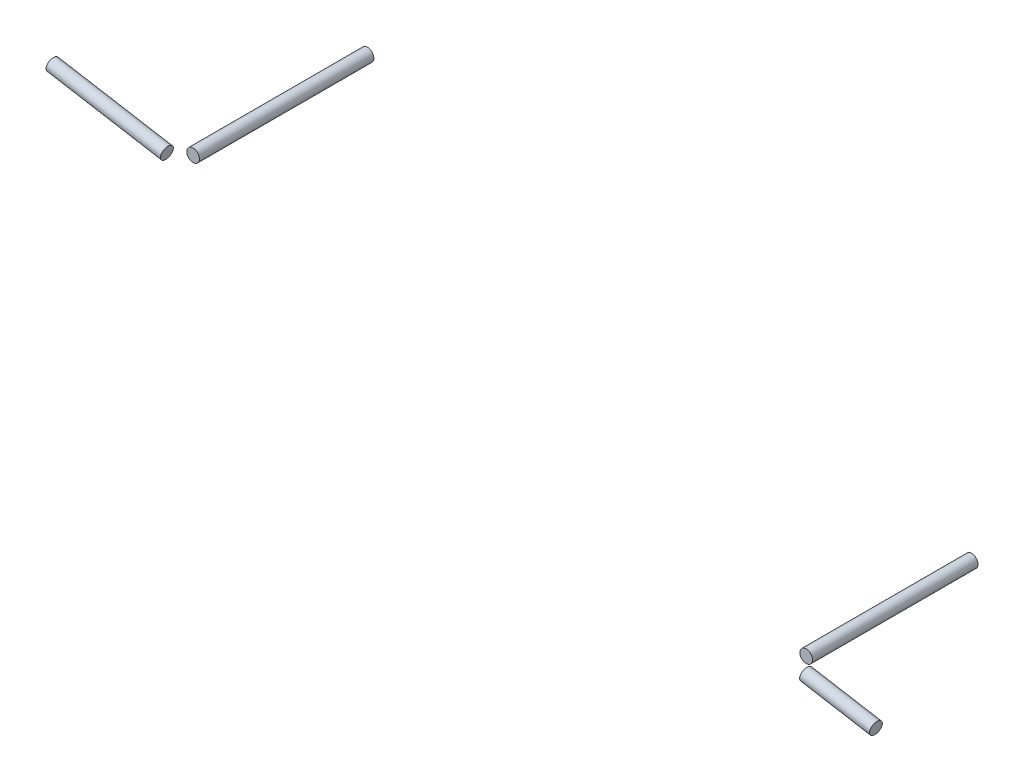
ISO-10303-21;
HEADER;
FILE_DESCRIPTION(('STEP AP214'),'2;1');
FILE_NAME('part.step','',(''),(''),'','','');
FILE_SCHEMA(('AUTOMOTIVE_DESIGN { 1 0 10303 214 1 1 1 1 }'));
ENDSEC;
DATA;
#1=APPLICATION_CONTEXT('core data for automotive mechanical design processes');
#2=APPLICATION_PROTOCOL_DEFINITION('international standard','automotive_design',2000,#1);
#3=PRODUCT_CONTEXT('',#1,'mechanical');
#4=PRODUCT('Part','Part','',(#3));
#5=PRODUCT_RELATED_PRODUCT_CATEGORY('part','',(#4));
#6=PRODUCT_DEFINITION_FORMATION('','',#4);
#7=PRODUCT_DEFINITION_CONTEXT('part definition',#1,'design');
#8=PRODUCT_DEFINITION('design','',#6,#7);
#9=PRODUCT_DEFINITION_SHAPE('','',#8);
#10=(LENGTH_UNIT() NAMED_UNIT(*) SI_UNIT(.MILLI.,.METRE.));
#11=(NAMED_UNIT(*) PLANE_ANGLE_UNIT() SI_UNIT($,.RADIAN.));
#12=(NAMED_UNIT(*) SI_UNIT($,.STERADIAN.) SOLID_ANGLE_UNIT());
#13=UNCERTAINTY_MEASURE_WITH_UNIT(LENGTH_MEASURE(1.E-05),#10,'distance_accuracy_value','');
#14=(GEOMETRIC_REPRESENTATION_CONTEXT(3) GLOBAL_UNCERTAINTY_ASSIGNED_CONTEXT((#13)) GLOBAL_UNIT_ASSIGNED_CONTEXT((#10,
#11,#12)) REPRESENTATION_CONTEXT('',''));
#15=CARTESIAN_POINT('',(0.,0.,0.));
#16=DIRECTION('',(0.,0.,1.));
#17=DIRECTION('',(1.,0.,0.));
#18=AXIS2_PLACEMENT_3D('',#15,#16,#17);
#19=CARTESIAN_POINT('',(-615.000680403424,127.640919006454,-49.811996396273));
#20=DIRECTION('',(0.,0.,1.));
#21=DIRECTION('',(1.,0.,0.));
#22=AXIS2_PLACEMENT_3D('',#19,#20,#21);
#23=CYLINDRICAL_SURFACE('',#22,6.34999999999994);
#24=CARTESIAN_POINT('',(-615.000680403424,127.640919006454,-31.8514841541348));
#25=DIRECTION('',(0.,0.,1.));
#26=DIRECTION('',(1.,0.,0.));
#27=AXIS2_PLACEMENT_3D('',#24,#25,#26);
#28=CIRCLE('',#27,6.34999999999994);
#29=CARTESIAN_POINT('',(-608.650680403424,127.640919006454,-31.8514841541348));
#30=VERTEX_POINT('',#29);
#31=EDGE_CURVE('E11',#30,#30,#28,.F.);
#32=CARTESIAN_POINT('',(-615.000680403424,127.640919006454,143.124127760595));
#33=DIRECTION('',(0.,0.,1.));
#34=DIRECTION('',(1.,0.,0.));
#35=AXIS2_PLACEMENT_3D('',#32,#33,#34);
#36=CIRCLE('',#35,6.34999999999994);
#37=CARTESIAN_POINT('',(-608.650680403424,127.640919006454,143.124127760595));
#38=VERTEX_POINT('',#37);
#39=EDGE_CURVE('E52',#38,#38,#36,.T.);
#40=CARTESIAN_POINT('',(-608.650680403424,127.640919006454,-31.8514841541348));
#41=CARTESIAN_POINT('',(-608.650680403424,127.640919006454,-30.028821530023));
#42=CARTESIAN_POINT('',(-608.650680403424,127.640919006454,-28.2061589059112));
#43=CARTESIAN_POINT('',(-608.650680403424,127.640919006454,-24.5608336576877));
#44=CARTESIAN_POINT('',(-608.650680403424,127.640919006454,-22.7381710335759));
#45=CARTESIAN_POINT('',(-608.650680403424,127.640919006454,-19.0928457853524));
#46=CARTESIAN_POINT('',(-608.650680403424,127.640919006454,-17.2701831612406));
#47=CARTESIAN_POINT('',(-608.650680403424,127.640919006454,-13.6248579130171));
#48=CARTESIAN_POINT('',(-608.650680403424,127.640919006454,-11.8021952889053));
#49=CARTESIAN_POINT('',(-608.650680403424,127.640919006454,-8.15687004068178));
#50=CARTESIAN_POINT('',(-608.650680403424,127.640919006454,-6.33420741657001));
#51=CARTESIAN_POINT('',(-608.650680403424,127.640919006454,-2.68888216834648));
#52=CARTESIAN_POINT('',(-608.650680403424,127.640919006454,-0.866219544234709));
#53=CARTESIAN_POINT('',(-608.650680403424,127.640919006454,2.77910570398883));
#54=CARTESIAN_POINT('',(-608.650680403424,127.640919006454,4.6017683281006));
#55=CARTESIAN_POINT('',(-608.650680403424,127.640919006454,8.24709357632414));
#56=CARTESIAN_POINT('',(-608.650680403424,127.640919006454,10.0697562004359));
#57=CARTESIAN_POINT('',(-608.650680403424,127.640919006454,13.7150814486594));
#58=CARTESIAN_POINT('',(-608.650680403424,127.640919006454,15.5377440727712));
#59=CARTESIAN_POINT('',(-608.650680403424,127.640919006454,19.1830693209947));
#60=CARTESIAN_POINT('',(-608.650680403424,127.640919006454,21.0057319451065));
#61=CARTESIAN_POINT('',(-608.650680403424,127.640919006454,24.6510571933301));
#62=CARTESIAN_POINT('',(-608.650680403424,127.640919006454,26.4737198174418));
#63=CARTESIAN_POINT('',(-608.650680403424,127.640919006454,30.1190450656654));
#64=CARTESIAN_POINT('',(-608.650680403424,127.640919006454,31.9417076897771));
#65=CARTESIAN_POINT('',(-608.650680403424,127.640919006454,35.5870329380007));
#66=CARTESIAN_POINT('',(-608.650680403424,127.640919006454,37.4096955621124));
#67=CARTESIAN_POINT('',(-608.650680403424,127.640919006454,41.055020810336));
#68=CARTESIAN_POINT('',(-608.650680403424,127.640919006454,42.8776834344477));
#69=CARTESIAN_POINT('',(-608.650680403424,127.640919006454,46.5230086826713));
#70=CARTESIAN_POINT('',(-608.650680403424,127.640919006454,48.345671306783));
#71=CARTESIAN_POINT('',(-608.650680403424,127.640919006454,51.9909965550066));
#72=CARTESIAN_POINT('',(-608.650680403424,127.640919006454,53.8136591791184));
#73=CARTESIAN_POINT('',(-608.650680403424,127.640919006454,57.4589844273419));
#74=CARTESIAN_POINT('',(-608.650680403424,127.640919006454,59.2816470514537));
#75=CARTESIAN_POINT('',(-608.650680403424,127.640919006454,62.9269722996772));
#76=CARTESIAN_POINT('',(-608.650680403424,127.640919006454,64.749634923789));
#77=CARTESIAN_POINT('',(-608.650680403424,127.640919006454,68.3949601720125));
#78=CARTESIAN_POINT('',(-608.650680403424,127.640919006454,70.2176227961243));
#79=CARTESIAN_POINT('',(-608.650680403424,127.640919006454,73.8629480443478));
#80=CARTESIAN_POINT('',(-608.650680403424,127.640919006454,75.6856106684596));
#81=CARTESIAN_POINT('',(-608.650680403424,127.640919006454,79.3309359166831));
#82=CARTESIAN_POINT('',(-608.650680403424,127.640919006454,81.1535985407949));
#83=CARTESIAN_POINT('',(-608.650680403424,127.640919006454,84.7989237890184));
#84=CARTESIAN_POINT('',(-608.650680403424,127.640919006454,86.6215864131302));
#85=CARTESIAN_POINT('',(-608.650680403424,127.640919006454,90.2669116613537));
#86=CARTESIAN_POINT('',(-608.650680403424,127.640919006454,92.0895742854655));
#87=CARTESIAN_POINT('',(-608.650680403424,127.640919006454,95.734899533689));
#88=CARTESIAN_POINT('',(-608.650680403424,127.640919006454,97.5575621578008));
#89=CARTESIAN_POINT('',(-608.650680403424,127.640919006454,101.202887406024));
#90=CARTESIAN_POINT('',(-608.650680403424,127.640919006454,103.025550030136));
#91=CARTESIAN_POINT('',(-608.650680403424,127.640919006454,106.67087527836));
#92=CARTESIAN_POINT('',(-608.650680403424,127.640919006454,108.493537902471));
#93=CARTESIAN_POINT('',(-608.650680403424,127.640919006454,112.138863150695));
#94=CARTESIAN_POINT('',(-608.650680403424,127.640919006454,113.961525774807));
#95=CARTESIAN_POINT('',(-608.650680403424,127.640919006454,117.60685102303));
#96=CARTESIAN_POINT('',(-608.650680403424,127.640919006454,119.429513647142));
#97=CARTESIAN_POINT('',(-608.650680403424,127.640919006454,123.074838895366));
#98=CARTESIAN_POINT('',(-608.650680403424,127.640919006454,124.897501519477));
#99=CARTESIAN_POINT('',(-608.650680403424,127.640919006454,128.542826767701));
#100=CARTESIAN_POINT('',(-608.650680403424,127.640919006454,130.365489391813));
#101=CARTESIAN_POINT('',(-608.650680403424,127.640919006454,134.010814640036));
#102=CARTESIAN_POINT('',(-608.650680403424,127.640919006454,135.833477264148));
#103=CARTESIAN_POINT('',(-608.650680403424,127.640919006454,139.478802512371));
#104=CARTESIAN_POINT('',(-608.650680403424,127.640919006454,141.301465136483));
#105=CARTESIAN_POINT('',(-608.650680403424,127.640919006454,143.124127760595));
#106=B_SPLINE_CURVE_WITH_KNOTS('',3,(#40,#41,#42,#43,#44,#45,#46,#47,#48,#49,#50,#51,#52,#53,
#54,#55,#56,#57,#58,#59,#60,#61,#62,#63,#64,#65,#66,#67,#68,#69,#70,#71,#72,#73,#74,#75,#76,#77,
#78,#79,#80,#81,#82,#83,#84,#85,#86,#87,#88,#89,#90,#91,#92,#93,#94,#95,#96,#97,#98,#99,#100,
#101,#102,#103,#104,#105),.UNSPECIFIED.,.F.,.F.,(4,2,2,2,2,2,2,2,2,2,2,2,2,2,2,2,2,2,2,2,2,2,2,
2,2,2,2,2,2,2,2,2,4),(0.,5.46798787233531,10.9359757446706,16.4039636170059,21.8719514893412,
27.3399393616765,32.8079272340118,38.2759151063471,43.7439029786824,49.2118908510177,
54.6798787233531,60.1478665956884,65.6158544680237,71.083842340359,76.5518302126943,
82.0198180850296,87.4878059573649,92.9557938297002,98.4237817020355,103.891769574371,
109.359757446706,114.827745319041,120.295733191377,125.763721063712,131.231708936047,
136.699696808383,142.167684680718,147.635672553053,153.103660425389,158.571648297724,
164.039636170059,169.507624042394,174.97561191473),.UNSPECIFIED.);
#107=EDGE_CURVE('BSEAM46',#30,#38,#106,.T.);
#108=ORIENTED_EDGE('',*,*,#31,.F.);
#109=ORIENTED_EDGE('',*,*,#39,.F.);
#110=ORIENTED_EDGE('',*,*,#107,.T.);
#111=ORIENTED_EDGE('',*,*,#107,.F.);
#112=EDGE_LOOP('',(#108,#110,#109,#111));
#113=FACE_BOUND('',#112,.T.);
#114=ADVANCED_FACE('F46',(#113),#23,.T.);
#115=CARTESIAN_POINT('',(-615.000680403424,127.640919006454,143.124127760595));
#116=DIRECTION('',(0.,0.,1.));
#117=DIRECTION('',(1.,0.,0.));
#118=AXIS2_PLACEMENT_3D('',#115,#116,#117);
#119=PLANE('',#118);
#120=ORIENTED_EDGE('',*,*,#39,.T.);
#121=EDGE_LOOP('',(#120));
#122=FACE_BOUND('',#121,.T.);
#123=ADVANCED_FACE('F58',(#122),#119,.T.);
#124=CARTESIAN_POINT('',(0.,0.,-31.8514841541348));
#125=DIRECTION('',(0.,0.,1.));
#126=DIRECTION('',(1.,0.,0.));
#127=AXIS2_PLACEMENT_3D('',#124,#125,#126);
#128=PLANE('',#127);
#129=ORIENTED_EDGE('',*,*,#31,.T.);
#130=EDGE_LOOP('',(#129));
#131=FACE_BOUND('',#130,.T.);
#132=ADVANCED_FACE('F65',(#131),#128,.F.);
#133=CLOSED_SHELL('',(#114,#123,#132));
#134=MANIFOLD_SOLID_BREP('B2',#133);
#135=CARTESIAN_POINT('',(-631.725947745237,108.235350192216,0.));
#136=DIRECTION('',(0.985637977292356,-0.168872075012515,0.));
#137=DIRECTION('',(0.168872075012515,0.985637977292356,0.));
#138=AXIS2_PLACEMENT_3D('',#135,#136,#137);
#139=PLANE('',#138);
#140=CARTESIAN_POINT('',(-628.018986807503,129.871381373208,156.332127760596));
#141=DIRECTION('',(0.985637977292356,-0.168872075012515,0.));
#142=DIRECTION('',(0.168872075012515,0.985637977292356,0.));
#143=AXIS2_PLACEMENT_3D('',#140,#141,#142);
#144=CIRCLE('',#143,6.35000000000994);
#145=CARTESIAN_POINT('',(-626.946649131172,136.130182529024,156.332127760596));
#146=VERTEX_POINT('',#145);
#147=EDGE_CURVE('E45',#146,#146,#144,.F.);
#148=ORIENTED_EDGE('',*,*,#147,.F.);
#149=EDGE_LOOP('',(#148));
#150=FACE_BOUND('',#149,.T.);
#151=ADVANCED_FACE('F95',(#150),#139,.T.);
#152=CARTESIAN_POINT('',(-742.880393734009,149.550903239665,156.332127760597));
#153=DIRECTION('',(-0.985637977292356,0.168872075012516,0.));
#154=DIRECTION('',(-0.168872075012516,-0.985637977292356,0.));
#155=AXIS2_PLACEMENT_3D('',#152,#153,#154);
#156=PLANE('',#155);
#157=CARTESIAN_POINT('',(-742.880393734009,149.550903239665,156.332127760597));
#158=DIRECTION('',(-0.985637977292356,0.168872075012516,0.));
#159=DIRECTION('',(-0.168872075012516,-0.985637977292356,0.));
#160=AXIS2_PLACEMENT_3D('',#157,#158,#159);
#161=CIRCLE('',#160,6.35000000000994);
#162=CARTESIAN_POINT('',(-743.95273141034,143.292102083849,156.332127760597));
#163=VERTEX_POINT('',#162);
#164=EDGE_CURVE('E101',#163,#163,#161,.T.);
#165=ORIENTED_EDGE('',*,*,#164,.T.);
#166=EDGE_LOOP('',(#165));
#167=FACE_BOUND('',#166,.T.);
#168=ADVANCED_FACE('F107',(#167),#156,.T.);
#169=CARTESIAN_POINT('',(-610.31642385,126.838352402585,156.332127760596));
#170=DIRECTION('',(-0.985637977292356,0.168872075012516,0.));
#171=DIRECTION('',(-0.168872075012516,-0.985637977292356,0.));
#172=AXIS2_PLACEMENT_3D('',#169,#170,#171);
#173=CYLINDRICAL_SURFACE('',#172,6.35000000000994);
#174=ORIENTED_EDGE('',*,*,#164,.F.);
#175=EDGE_LOOP('',(#174));
#176=FACE_BOUND('',#175,.T.);
#177=ORIENTED_EDGE('',*,*,#147,.T.);
#178=EDGE_LOOP('',(#177));
#179=FACE_BOUND('',#178,.T.);
#180=ADVANCED_FACE('F109',(#176,#179),#173,.T.);
#181=CLOSED_SHELL('',(#151,#168,#180));
#182=MANIFOLD_SOLID_BREP('B6',#181);
#183=CARTESIAN_POINT('',(0.,0.,-22.86));
#184=DIRECTION('',(0.,0.,-1.));
#185=DIRECTION('',(-1.,0.,0.));
#186=AXIS2_PLACEMENT_3D('',#183,#184,#185);
#187=PLANE('',#186);
#188=CARTESIAN_POINT('',(-3.25921065324845E-12,5.52327896855765E-13,-22.86));
#189=DIRECTION('',(0.,0.,-1.));
#190=DIRECTION('',(-1.,0.,0.));
#191=AXIS2_PLACEMENT_3D('',#188,#189,#190);
#192=CIRCLE('',#191,6.3499999999791);
#193=CARTESIAN_POINT('',(-6.34999999998236,5.52327896855765E-13,-22.86));
#194=VERTEX_POINT('',#193);
#195=EDGE_CURVE('E94',#194,#194,#192,.F.);
#196=ORIENTED_EDGE('',*,*,#195,.F.);
#197=EDGE_LOOP('',(#196));
#198=FACE_BOUND('',#197,.T.);
#199=ADVANCED_FACE('F144',(#198),#187,.T.);
#200=CARTESIAN_POINT('',(-3.25921065324845E-12,5.52327896855765E-13,143.124127760595));
#201=DIRECTION('',(0.,0.,1.));
#202=DIRECTION('',(1.,0.,0.));
#203=AXIS2_PLACEMENT_3D('',#200,#201,#202);
#204=PLANE('',#203);
#205=CARTESIAN_POINT('',(-3.25921065324845E-12,5.52327896855765E-13,143.124127760595));
#206=DIRECTION('',(0.,0.,1.));
#207=DIRECTION('',(1.,0.,0.));
#208=AXIS2_PLACEMENT_3D('',#205,#206,#207);
#209=CIRCLE('',#208,6.3499999999791);
#210=CARTESIAN_POINT('',(6.34999999997584,5.52327896855765E-13,143.124127760595));
#211=VERTEX_POINT('',#210);
#212=EDGE_CURVE('E150',#211,#211,#209,.T.);
#213=ORIENTED_EDGE('',*,*,#212,.T.);
#214=EDGE_LOOP('',(#213));
#215=FACE_BOUND('',#214,.T.);
#216=ADVANCED_FACE('F156',(#215),#204,.T.);
#217=CARTESIAN_POINT('',(-3.25921065324845E-12,5.52327896855765E-13,-40.8205122420792));
#218=DIRECTION('',(0.,0.,1.));
#219=DIRECTION('',(1.,0.,0.));
#220=AXIS2_PLACEMENT_3D('',#217,#218,#219);
#221=CYLINDRICAL_SURFACE('',#220,6.3499999999791);
#222=ORIENTED_EDGE('',*,*,#212,.F.);
#223=EDGE_LOOP('',(#222));
#224=FACE_BOUND('',#223,.T.);
#225=ORIENTED_EDGE('',*,*,#195,.T.);
#226=EDGE_LOOP('',(#225));
#227=FACE_BOUND('',#226,.T.);
#228=ADVANCED_FACE('F158',(#224,#227),#221,.T.);
#229=CLOSED_SHELL('',(#199,#216,#228));
#230=MANIFOLD_SOLID_BREP('B40',#229);
#231=CARTESIAN_POINT('',(100.856995113516,-17.2801073383306,156.332127760595));
#232=DIRECTION('',(-0.985637977292356,0.168872075012519,0.));
#233=DIRECTION('',(-0.168872075012519,-0.985637977292356,0.));
#234=AXIS2_PLACEMENT_3D('',#231,#232,#233);
#235=CYLINDRICAL_SURFACE('',#234,6.34999999999994);
#236=CARTESIAN_POINT('',(83.1544321560408,-14.247078367713,156.332127760595));
#237=DIRECTION('',(-0.985637977292356,0.168872075012519,0.));
#238=DIRECTION('',(-0.168872075012519,-0.985637977292356,0.));
#239=AXIS2_PLACEMENT_3D('',#236,#237,#238);
#240=CIRCLE('',#239,6.34999999999994);
#241=CARTESIAN_POINT('',(82.0820944797113,-20.5058795235194,156.332127760595));
#242=VERTEX_POINT('',#241);
#243=EDGE_CURVE('E143',#242,#242,#240,.F.);
#244=ORIENTED_EDGE('',*,*,#243,.F.);
#245=EDGE_LOOP('',(#244));
#246=FACE_BOUND('',#245,.T.);
#247=CARTESIAN_POINT('',(13.0183064040775,-2.23046236676535,156.332127760595));
#248=DIRECTION('',(-0.985637977292356,0.168872075012519,0.));
#249=DIRECTION('',(-0.168872075012519,-0.985637977292356,0.));
#250=AXIS2_PLACEMENT_3D('',#247,#248,#249);
#251=CIRCLE('',#250,6.34999999999994);
#252=CARTESIAN_POINT('',(11.945968727748,-8.48926352257175,156.332127760595));
#253=VERTEX_POINT('',#252);
#254=EDGE_CURVE('E199',#253,#253,#251,.T.);
#255=ORIENTED_EDGE('',*,*,#254,.F.);
#256=EDGE_LOOP('',(#255));
#257=FACE_BOUND('',#256,.T.);
#258=ADVANCED_FACE('F193',(#246,#257),#235,.T.);
#259=CARTESIAN_POINT('',(13.0183064040775,-2.23046236676535,156.332127760595));
#260=DIRECTION('',(-0.985637977292356,0.168872075012519,0.));
#261=DIRECTION('',(-0.168872075012519,-0.985637977292356,0.));
#262=AXIS2_PLACEMENT_3D('',#259,#260,#261);
#263=PLANE('',#262);
#264=ORIENTED_EDGE('',*,*,#254,.T.);
#265=EDGE_LOOP('',(#264));
#266=FACE_BOUND('',#265,.T.);
#267=ADVANCED_FACE('F205',(#266),#263,.T.);
#268=CARTESIAN_POINT('',(83.1544321560409,-14.2470783677131,0.));
#269=DIRECTION('',(-0.985637977292356,0.168872075012519,0.));
#270=DIRECTION('',(-0.168872075012519,-0.985637977292356,0.));
#271=AXIS2_PLACEMENT_3D('',#268,#269,#270);
#272=PLANE('',#271);
#273=ORIENTED_EDGE('',*,*,#243,.T.);
#274=EDGE_LOOP('',(#273));
#275=FACE_BOUND('',#274,.T.);
#276=ADVANCED_FACE('F212',(#275),#272,.F.);
#277=CLOSED_SHELL('',(#258,#267,#276));
#278=MANIFOLD_SOLID_BREP('B89',#277);
#279=ADVANCED_BREP_SHAPE_REPRESENTATION('',(#18,#134,#182,#230,#278),#14);
#280=SHAPE_DEFINITION_REPRESENTATION(#9,#279);
ENDSEC;
END-ISO-10303-21;
